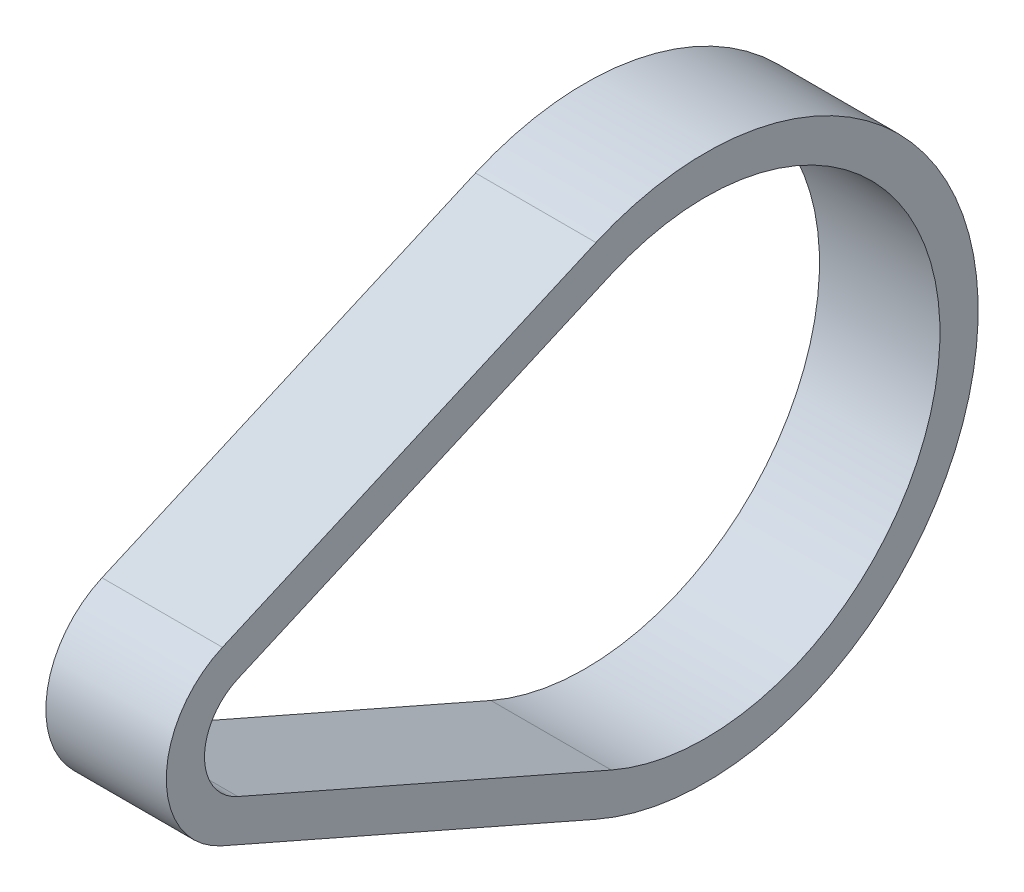
ISO-10303-21;
HEADER;
FILE_DESCRIPTION(('STEP AP214'),'2;1');
FILE_NAME('part.step','',(''),(''),'','','');
FILE_SCHEMA(('AUTOMOTIVE_DESIGN { 1 0 10303 214 1 1 1 1 }'));
ENDSEC;
DATA;
#1=APPLICATION_CONTEXT('core data for automotive mechanical design processes');
#2=APPLICATION_PROTOCOL_DEFINITION('international standard','automotive_design',2000,#1);
#3=PRODUCT_CONTEXT('',#1,'mechanical');
#4=PRODUCT('Part','Part','',(#3));
#5=PRODUCT_RELATED_PRODUCT_CATEGORY('part','',(#4));
#6=PRODUCT_DEFINITION_FORMATION('','',#4);
#7=PRODUCT_DEFINITION_CONTEXT('part definition',#1,'design');
#8=PRODUCT_DEFINITION('design','',#6,#7);
#9=PRODUCT_DEFINITION_SHAPE('','',#8);
#10=(LENGTH_UNIT() NAMED_UNIT(*) SI_UNIT(.MILLI.,.METRE.));
#11=(NAMED_UNIT(*) PLANE_ANGLE_UNIT() SI_UNIT($,.RADIAN.));
#12=(NAMED_UNIT(*) SI_UNIT($,.STERADIAN.) SOLID_ANGLE_UNIT());
#13=UNCERTAINTY_MEASURE_WITH_UNIT(LENGTH_MEASURE(1.E-05),#10,'distance_accuracy_value','');
#14=(GEOMETRIC_REPRESENTATION_CONTEXT(3) GLOBAL_UNCERTAINTY_ASSIGNED_CONTEXT((#13)) GLOBAL_UNIT_ASSIGNED_CONTEXT((#10,
#11,#12)) REPRESENTATION_CONTEXT('',''));
#15=CARTESIAN_POINT('',(0.,0.,0.));
#16=DIRECTION('',(0.,0.,1.));
#17=DIRECTION('',(1.,0.,0.));
#18=AXIS2_PLACEMENT_3D('',#15,#16,#17);
#19=CARTESIAN_POINT('',(7.5,0.,0.));
#20=DIRECTION('',(1.,0.,0.));
#21=DIRECTION('',(0.,0.,-1.));
#22=AXIS2_PLACEMENT_3D('',#19,#20,#21);
#23=PLANE('',#22);
#24=CARTESIAN_POINT('',(7.5,0.,0.));
#25=DIRECTION('',(1.,0.,0.));
#26=DIRECTION('',(0.,0.,-1.));
#27=AXIS2_PLACEMENT_3D('',#24,#25,#26);
#28=CIRCLE('',#27,11.68908);
#29=CARTESIAN_POINT('',(7.5,10.7050218549064,4.69436878955805));
#30=VERTEX_POINT('',#29);
#31=CARTESIAN_POINT('',(7.5,-10.7050218549064,4.69436878955805));
#32=VERTEX_POINT('',#31);
#33=EDGE_CURVE('E137',#30,#32,#28,.T.);
#34=ORIENTED_EDGE('',*,*,#33,.T.);
#35=DIRECTION('',(0.,-0.401602931073964,-0.91581389253101));
#36=VECTOR('',#35,1.);
#37=CARTESIAN_POINT('',(7.5,-10.7050218549064,4.69436878955805));
#38=LINE('',#37,#36);
#39=CARTESIAN_POINT('',(7.5,-31.1031827948616,-41.8215247098695));
#40=VERTEX_POINT('',#39);
#41=EDGE_CURVE('E140',#32,#40,#38,.T.);
#42=ORIENTED_EDGE('',*,*,#41,.T.);
#43=CARTESIAN_POINT('',(7.5,0.,-55.4609));
#44=DIRECTION('',(1.,0.,0.));
#45=DIRECTION('',(0.,0.,-1.));
#46=AXIS2_PLACEMENT_3D('',#43,#44,#45);
#47=CIRCLE('',#46,33.96234);
#48=CARTESIAN_POINT('',(7.5,31.1031827948616,-41.8215247098695));
#49=VERTEX_POINT('',#48);
#50=EDGE_CURVE('E143',#40,#49,#47,.T.);
#51=ORIENTED_EDGE('',*,*,#50,.T.);
#52=DIRECTION('',(0.,-0.401602931073964,0.91581389253101));
#53=VECTOR('',#52,1.);
#54=CARTESIAN_POINT('',(7.5,10.7050218549064,4.69436878955805));
#55=LINE('',#54,#53);
#56=EDGE_CURVE('E145',#49,#30,#55,.T.);
#57=ORIENTED_EDGE('',*,*,#56,.T.);
#58=EDGE_LOOP('',(#34,#42,#51,#57));
#59=FACE_BOUND('',#58,.T.);
#60=DIRECTION('',(0.,-0.401602931073964,-0.915813892531011));
#61=VECTOR('',#60,1.);
#62=CARTESIAN_POINT('',(7.5,-6.34345819172745,2.7817348303183));
#63=LINE('',#62,#61);
#64=CARTESIAN_POINT('',(7.5,-6.34345819172745,2.7817348303183));
#65=VERTEX_POINT('',#64);
#66=CARTESIAN_POINT('',(7.5,-26.7416191316827,-43.7341586691092));
#67=VERTEX_POINT('',#66);
#68=EDGE_CURVE('E109',#65,#67,#63,.T.);
#69=ORIENTED_EDGE('',*,*,#68,.F.);
#70=CARTESIAN_POINT('',(7.5,0.,0.));
#71=DIRECTION('',(1.,0.,0.));
#72=DIRECTION('',(0.,0.,-1.));
#73=AXIS2_PLACEMENT_3D('',#70,#71,#72);
#74=CIRCLE('',#73,6.92658);
#75=CARTESIAN_POINT('',(7.5,6.34345819172745,2.7817348303183));
#76=VERTEX_POINT('',#75);
#77=EDGE_CURVE('E101',#76,#65,#74,.T.);
#78=ORIENTED_EDGE('',*,*,#77,.F.);
#79=DIRECTION('',(0.,-0.401602931073963,0.915813892531011));
#80=VECTOR('',#79,1.);
#81=CARTESIAN_POINT('',(7.5,6.34345819172745,2.7817348303183));
#82=LINE('',#81,#80);
#83=CARTESIAN_POINT('',(7.5,26.7416191316827,-43.7341586691092));
#84=VERTEX_POINT('',#83);
#85=EDGE_CURVE('E123',#84,#76,#82,.T.);
#86=ORIENTED_EDGE('',*,*,#85,.F.);
#87=CARTESIAN_POINT('',(7.5,0.,-55.4609));
#88=DIRECTION('',(1.,0.,0.));
#89=DIRECTION('',(0.,0.,-1.));
#90=AXIS2_PLACEMENT_3D('',#87,#88,#89);
#91=CIRCLE('',#90,29.19984);
#92=EDGE_CURVE('E121',#67,#84,#91,.T.);
#93=ORIENTED_EDGE('',*,*,#92,.F.);
#94=EDGE_LOOP('',(#69,#78,#86,#93));
#95=FACE_BOUND('',#94,.T.);
#96=ADVANCED_FACE('F36',(#59,#95),#23,.T.);
#97=CARTESIAN_POINT('',(-7.5,0.,0.));
#98=DIRECTION('',(1.,0.,0.));
#99=DIRECTION('',(0.,0.,-1.));
#100=AXIS2_PLACEMENT_3D('',#97,#98,#99);
#101=PLANE('',#100);
#102=CARTESIAN_POINT('',(-7.5,0.,0.));
#103=DIRECTION('',(1.,0.,0.));
#104=DIRECTION('',(0.,0.,-1.));
#105=AXIS2_PLACEMENT_3D('',#102,#103,#104);
#106=CIRCLE('',#105,11.68908);
#107=CARTESIAN_POINT('',(-7.5,10.7050218549064,4.69436878955805));
#108=VERTEX_POINT('',#107);
#109=CARTESIAN_POINT('',(-7.5,-10.7050218549064,4.69436878955805));
#110=VERTEX_POINT('',#109);
#111=EDGE_CURVE('E117',#108,#110,#106,.T.);
#112=ORIENTED_EDGE('',*,*,#111,.F.);
#113=DIRECTION('',(0.,-0.401602931073964,0.91581389253101));
#114=VECTOR('',#113,1.);
#115=CARTESIAN_POINT('',(-7.5,10.7050218549064,4.69436878955805));
#116=LINE('',#115,#114);
#117=CARTESIAN_POINT('',(-7.5,31.1031827948616,-41.8215247098695));
#118=VERTEX_POINT('',#117);
#119=EDGE_CURVE('E141',#118,#108,#116,.T.);
#120=ORIENTED_EDGE('',*,*,#119,.F.);
#121=CARTESIAN_POINT('',(-7.5,0.,-55.4609));
#122=DIRECTION('',(1.,0.,0.));
#123=DIRECTION('',(0.,0.,-1.));
#124=AXIS2_PLACEMENT_3D('',#121,#122,#123);
#125=CIRCLE('',#124,33.96234);
#126=CARTESIAN_POINT('',(-7.5,-31.1031827948616,-41.8215247098695));
#127=VERTEX_POINT('',#126);
#128=EDGE_CURVE('E152',#127,#118,#125,.T.);
#129=ORIENTED_EDGE('',*,*,#128,.F.);
#130=DIRECTION('',(0.,-0.401602931073964,-0.91581389253101));
#131=VECTOR('',#130,1.);
#132=CARTESIAN_POINT('',(-7.5,-10.7050218549064,4.69436878955805));
#133=LINE('',#132,#131);
#134=EDGE_CURVE('E150',#110,#127,#133,.T.);
#135=ORIENTED_EDGE('',*,*,#134,.F.);
#136=EDGE_LOOP('',(#112,#120,#129,#135));
#137=FACE_BOUND('',#136,.T.);
#138=CARTESIAN_POINT('',(-7.5,0.,0.));
#139=DIRECTION('',(1.,0.,0.));
#140=DIRECTION('',(0.,0.,-1.));
#141=AXIS2_PLACEMENT_3D('',#138,#139,#140);
#142=CIRCLE('',#141,6.92658);
#143=CARTESIAN_POINT('',(-7.5,6.34345819172745,2.7817348303183));
#144=VERTEX_POINT('',#143);
#145=CARTESIAN_POINT('',(-7.5,-6.34345819172745,2.7817348303183));
#146=VERTEX_POINT('',#145);
#147=EDGE_CURVE('E59',#144,#146,#142,.T.);
#148=ORIENTED_EDGE('',*,*,#147,.T.);
#149=DIRECTION('',(0.,-0.401602931073964,-0.915813892531011));
#150=VECTOR('',#149,1.);
#151=CARTESIAN_POINT('',(-7.5,-6.34345819172745,2.7817348303183));
#152=LINE('',#151,#150);
#153=CARTESIAN_POINT('',(-7.5,-26.7416191316827,-43.7341586691092));
#154=VERTEX_POINT('',#153);
#155=EDGE_CURVE('E116',#146,#154,#152,.T.);
#156=ORIENTED_EDGE('',*,*,#155,.T.);
#157=CARTESIAN_POINT('',(-7.5,0.,-55.4609));
#158=DIRECTION('',(1.,0.,0.));
#159=DIRECTION('',(0.,0.,-1.));
#160=AXIS2_PLACEMENT_3D('',#157,#158,#159);
#161=CIRCLE('',#160,29.19984);
#162=CARTESIAN_POINT('',(-7.5,26.7416191316827,-43.7341586691092));
#163=VERTEX_POINT('',#162);
#164=EDGE_CURVE('E129',#154,#163,#161,.T.);
#165=ORIENTED_EDGE('',*,*,#164,.T.);
#166=DIRECTION('',(0.,-0.401602931073963,0.915813892531011));
#167=VECTOR('',#166,1.);
#168=CARTESIAN_POINT('',(-7.5,6.34345819172745,2.7817348303183));
#169=LINE('',#168,#167);
#170=EDGE_CURVE('E110',#163,#144,#169,.T.);
#171=ORIENTED_EDGE('',*,*,#170,.T.);
#172=EDGE_LOOP('',(#148,#156,#165,#171));
#173=FACE_BOUND('',#172,.T.);
#174=ADVANCED_FACE('F170',(#137,#173),#101,.F.);
#175=CARTESIAN_POINT('',(7.5,0.,0.));
#176=DIRECTION('',(-1.,0.,0.));
#177=DIRECTION('',(0.,0.,1.));
#178=AXIS2_PLACEMENT_3D('',#175,#176,#177);
#179=CYLINDRICAL_SURFACE('',#178,11.68908);
#180=ORIENTED_EDGE('',*,*,#111,.T.);
#181=DIRECTION('',(-1.,0.,0.));
#182=VECTOR('',#181,1.);
#183=CARTESIAN_POINT('',(7.5,-10.7050218549064,4.69436878955805));
#184=LINE('',#183,#182);
#185=EDGE_CURVE('E11',#32,#110,#184,.T.);
#186=ORIENTED_EDGE('',*,*,#185,.F.);
#187=ORIENTED_EDGE('',*,*,#33,.F.);
#188=DIRECTION('',(-1.,0.,0.));
#189=VECTOR('',#188,1.);
#190=CARTESIAN_POINT('',(7.5,10.7050218549064,4.69436878955805));
#191=LINE('',#190,#189);
#192=EDGE_CURVE('E147',#30,#108,#191,.T.);
#193=ORIENTED_EDGE('',*,*,#192,.T.);
#194=EDGE_LOOP('',(#180,#186,#187,#193));
#195=FACE_BOUND('',#194,.T.);
#196=ADVANCED_FACE('F38',(#195),#179,.T.);
#197=CARTESIAN_POINT('',(7.5,-10.7050218549064,4.69436878955805));
#198=DIRECTION('',(0.,0.91581389253101,-0.401602931073964));
#199=DIRECTION('',(0.,0.401602931073964,0.91581389253101));
#200=AXIS2_PLACEMENT_3D('',#197,#198,#199);
#201=PLANE('',#200);
#202=ORIENTED_EDGE('',*,*,#134,.T.);
#203=DIRECTION('',(-1.,0.,0.));
#204=VECTOR('',#203,1.);
#205=CARTESIAN_POINT('',(7.5,-31.1031827948616,-41.8215247098695));
#206=LINE('',#205,#204);
#207=EDGE_CURVE('E44',#40,#127,#206,.T.);
#208=ORIENTED_EDGE('',*,*,#207,.F.);
#209=ORIENTED_EDGE('',*,*,#41,.F.);
#210=ORIENTED_EDGE('',*,*,#185,.T.);
#211=EDGE_LOOP('',(#202,#208,#209,#210));
#212=FACE_BOUND('',#211,.T.);
#213=ADVANCED_FACE('F180',(#212),#201,.F.);
#214=CARTESIAN_POINT('',(7.5,0.,-55.4609));
#215=DIRECTION('',(-1.,0.,0.));
#216=DIRECTION('',(0.,0.,1.));
#217=AXIS2_PLACEMENT_3D('',#214,#215,#216);
#218=CYLINDRICAL_SURFACE('',#217,33.96234);
#219=ORIENTED_EDGE('',*,*,#128,.T.);
#220=DIRECTION('',(-1.,0.,0.));
#221=VECTOR('',#220,1.);
#222=CARTESIAN_POINT('',(7.5,31.1031827948616,-41.8215247098695));
#223=LINE('',#222,#221);
#224=EDGE_CURVE('E157',#49,#118,#223,.T.);
#225=ORIENTED_EDGE('',*,*,#224,.F.);
#226=ORIENTED_EDGE('',*,*,#50,.F.);
#227=ORIENTED_EDGE('',*,*,#207,.T.);
#228=EDGE_LOOP('',(#219,#225,#226,#227));
#229=FACE_BOUND('',#228,.T.);
#230=ADVANCED_FACE('F164',(#229),#218,.T.);
#231=CARTESIAN_POINT('',(7.5,10.7050218549064,4.69436878955805));
#232=DIRECTION('',(0.,-0.91581389253101,-0.401602931073964));
#233=DIRECTION('',(0.,0.401602931073964,-0.91581389253101));
#234=AXIS2_PLACEMENT_3D('',#231,#232,#233);
#235=PLANE('',#234);
#236=ORIENTED_EDGE('',*,*,#119,.T.);
#237=ORIENTED_EDGE('',*,*,#192,.F.);
#238=ORIENTED_EDGE('',*,*,#56,.F.);
#239=ORIENTED_EDGE('',*,*,#224,.T.);
#240=EDGE_LOOP('',(#236,#237,#238,#239));
#241=FACE_BOUND('',#240,.T.);
#242=ADVANCED_FACE('F174',(#241),#235,.F.);
#243=CARTESIAN_POINT('',(7.5,0.,0.));
#244=DIRECTION('',(-1.,0.,0.));
#245=DIRECTION('',(0.,0.,1.));
#246=AXIS2_PLACEMENT_3D('',#243,#244,#245);
#247=CYLINDRICAL_SURFACE('',#246,6.92658);
#248=ORIENTED_EDGE('',*,*,#147,.F.);
#249=DIRECTION('',(-1.,0.,0.));
#250=VECTOR('',#249,1.);
#251=CARTESIAN_POINT('',(7.5,6.34345819172745,2.7817348303183));
#252=LINE('',#251,#250);
#253=EDGE_CURVE('E105',#76,#144,#252,.T.);
#254=ORIENTED_EDGE('',*,*,#253,.F.);
#255=ORIENTED_EDGE('',*,*,#77,.T.);
#256=DIRECTION('',(-1.,0.,0.));
#257=VECTOR('',#256,1.);
#258=CARTESIAN_POINT('',(7.5,-6.34345819172745,2.7817348303183));
#259=LINE('',#258,#257);
#260=EDGE_CURVE('E104',#65,#146,#259,.T.);
#261=ORIENTED_EDGE('',*,*,#260,.T.);
#262=EDGE_LOOP('',(#248,#254,#255,#261));
#263=FACE_BOUND('',#262,.T.);
#264=ADVANCED_FACE('F103',(#263),#247,.F.);
#265=CARTESIAN_POINT('',(7.5,-6.34345819172745,2.7817348303183));
#266=DIRECTION('',(0.,0.91581389253101,-0.401602931073964));
#267=DIRECTION('',(0.,0.401602931073964,0.915813892531011));
#268=AXIS2_PLACEMENT_3D('',#265,#266,#267);
#269=PLANE('',#268);
#270=ORIENTED_EDGE('',*,*,#155,.F.);
#271=ORIENTED_EDGE('',*,*,#260,.F.);
#272=ORIENTED_EDGE('',*,*,#68,.T.);
#273=DIRECTION('',(-1.,0.,0.));
#274=VECTOR('',#273,1.);
#275=CARTESIAN_POINT('',(7.5,-26.7416191316827,-43.7341586691092));
#276=LINE('',#275,#274);
#277=EDGE_CURVE('E118',#67,#154,#276,.T.);
#278=ORIENTED_EDGE('',*,*,#277,.T.);
#279=EDGE_LOOP('',(#270,#271,#272,#278));
#280=FACE_BOUND('',#279,.T.);
#281=ADVANCED_FACE('F113',(#280),#269,.T.);
#282=CARTESIAN_POINT('',(7.5,0.,-55.4609));
#283=DIRECTION('',(-1.,0.,0.));
#284=DIRECTION('',(0.,0.,1.));
#285=AXIS2_PLACEMENT_3D('',#282,#283,#284);
#286=CYLINDRICAL_SURFACE('',#285,29.19984);
#287=ORIENTED_EDGE('',*,*,#164,.F.);
#288=ORIENTED_EDGE('',*,*,#277,.F.);
#289=ORIENTED_EDGE('',*,*,#92,.T.);
#290=DIRECTION('',(-1.,0.,0.));
#291=VECTOR('',#290,1.);
#292=CARTESIAN_POINT('',(7.5,26.7416191316827,-43.7341586691092));
#293=LINE('',#292,#291);
#294=EDGE_CURVE('E51',#84,#163,#293,.T.);
#295=ORIENTED_EDGE('',*,*,#294,.T.);
#296=EDGE_LOOP('',(#287,#288,#289,#295));
#297=FACE_BOUND('',#296,.T.);
#298=ADVANCED_FACE('F203',(#297),#286,.F.);
#299=CARTESIAN_POINT('',(7.5,6.34345819172745,2.7817348303183));
#300=DIRECTION('',(0.,-0.915813892531011,-0.401602931073963));
#301=DIRECTION('',(0.,0.401602931073964,-0.915813892531011));
#302=AXIS2_PLACEMENT_3D('',#299,#300,#301);
#303=PLANE('',#302);
#304=ORIENTED_EDGE('',*,*,#170,.F.);
#305=ORIENTED_EDGE('',*,*,#294,.F.);
#306=ORIENTED_EDGE('',*,*,#85,.T.);
#307=ORIENTED_EDGE('',*,*,#253,.T.);
#308=EDGE_LOOP('',(#304,#305,#306,#307));
#309=FACE_BOUND('',#308,.T.);
#310=ADVANCED_FACE('F207',(#309),#303,.T.);
#311=CLOSED_SHELL('',(#96,#174,#196,#213,#230,#242,#264,#281,#298,#310));
#312=MANIFOLD_SOLID_BREP('B2',#311);
#313=ADVANCED_BREP_SHAPE_REPRESENTATION('',(#18,#312),#14);
#314=SHAPE_DEFINITION_REPRESENTATION(#9,#313);
ENDSEC;
END-ISO-10303-21;
